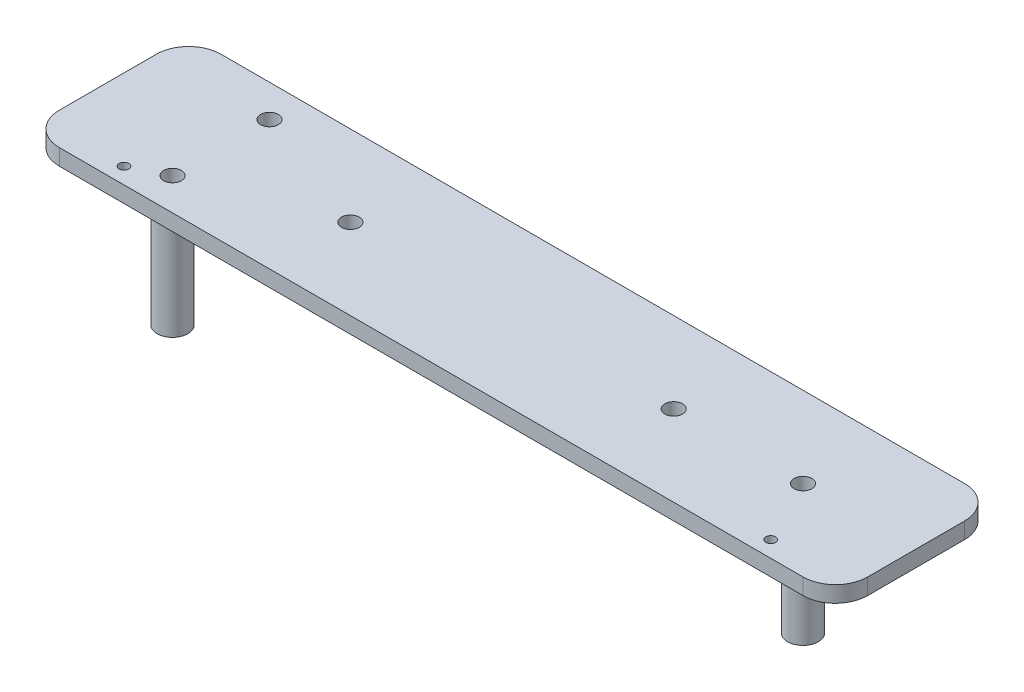
ISO-10303-21;
HEADER;
FILE_DESCRIPTION(('STEP AP214'),'2;1');
FILE_NAME('part.step','',(''),(''),'','','');
FILE_SCHEMA(('AUTOMOTIVE_DESIGN { 1 0 10303 214 1 1 1 1 }'));
ENDSEC;
DATA;
#1=APPLICATION_CONTEXT('core data for automotive mechanical design processes');
#2=APPLICATION_PROTOCOL_DEFINITION('international standard','automotive_design',2000,#1);
#3=PRODUCT_CONTEXT('',#1,'mechanical');
#4=PRODUCT('Part','Part','',(#3));
#5=PRODUCT_RELATED_PRODUCT_CATEGORY('part','',(#4));
#6=PRODUCT_DEFINITION_FORMATION('','',#4);
#7=PRODUCT_DEFINITION_CONTEXT('part definition',#1,'design');
#8=PRODUCT_DEFINITION('design','',#6,#7);
#9=PRODUCT_DEFINITION_SHAPE('','',#8);
#10=(LENGTH_UNIT() NAMED_UNIT(*) SI_UNIT(.MILLI.,.METRE.));
#11=(NAMED_UNIT(*) PLANE_ANGLE_UNIT() SI_UNIT($,.RADIAN.));
#12=(NAMED_UNIT(*) SI_UNIT($,.STERADIAN.) SOLID_ANGLE_UNIT());
#13=UNCERTAINTY_MEASURE_WITH_UNIT(LENGTH_MEASURE(1.E-05),#10,'distance_accuracy_value','');
#14=(GEOMETRIC_REPRESENTATION_CONTEXT(3) GLOBAL_UNCERTAINTY_ASSIGNED_CONTEXT((#13)) GLOBAL_UNIT_ASSIGNED_CONTEXT((#10,
#11,#12)) REPRESENTATION_CONTEXT('',''));
#15=CARTESIAN_POINT('',(0.,0.,0.));
#16=DIRECTION('',(0.,0.,1.));
#17=DIRECTION('',(1.,0.,0.));
#18=AXIS2_PLACEMENT_3D('',#15,#16,#17);
#19=CARTESIAN_POINT('',(115.,0.,-15.));
#20=DIRECTION('',(0.,-1.,0.));
#21=DIRECTION('',(0.,0.,-1.));
#22=AXIS2_PLACEMENT_3D('',#19,#20,#21);
#23=PLANE('',#22);
#24=CARTESIAN_POINT('',(-90.,0.,-15.));
#25=DIRECTION('',(0.,-1.,0.));
#26=DIRECTION('',(0.,0.,1.));
#27=AXIS2_PLACEMENT_3D('',#24,#25,#26);
#28=CIRCLE('',#27,4.75);
#29=CARTESIAN_POINT('',(-90.,0.,-10.25));
#30=VERTEX_POINT('',#29);
#31=EDGE_CURVE('E227',#30,#30,#28,.T.);
#32=ORIENTED_EDGE('',*,*,#31,.F.);
#33=EDGE_LOOP('',(#32));
#34=FACE_BOUND('',#33,.T.);
#35=CARTESIAN_POINT('',(-100.,0.,20.));
#36=DIRECTION('',(0.,1.,0.));
#37=DIRECTION('',(0.,0.,1.));
#38=AXIS2_PLACEMENT_3D('',#35,#36,#37);
#39=CIRCLE('',#38,1.5);
#40=CARTESIAN_POINT('',(-100.,0.,21.5));
#41=VERTEX_POINT('',#40);
#42=EDGE_CURVE('E210',#41,#41,#39,.T.);
#43=ORIENTED_EDGE('',*,*,#42,.T.);
#44=EDGE_LOOP('',(#43));
#45=FACE_BOUND('',#44,.T.);
#46=CARTESIAN_POINT('',(50.,0.,0.));
#47=DIRECTION('',(0.,1.,0.));
#48=DIRECTION('',(0.,0.,-1.));
#49=AXIS2_PLACEMENT_3D('',#46,#47,#48);
#50=CIRCLE('',#49,2.74999999999999);
#51=CARTESIAN_POINT('',(50.,0.,-2.75000000000001));
#52=VERTEX_POINT('',#51);
#53=EDGE_CURVE('E198',#52,#52,#50,.T.);
#54=ORIENTED_EDGE('',*,*,#53,.T.);
#55=EDGE_LOOP('',(#54));
#56=FACE_BOUND('',#55,.T.);
#57=CARTESIAN_POINT('',(115.,0.,-15.));
#58=DIRECTION('',(0.,1.,0.));
#59=DIRECTION('',(0.,0.,-1.));
#60=AXIS2_PLACEMENT_3D('',#57,#58,#59);
#61=CIRCLE('',#60,10.);
#62=CARTESIAN_POINT('',(125.,0.,-15.));
#63=VERTEX_POINT('',#62);
#64=CARTESIAN_POINT('',(115.,0.,-25.));
#65=VERTEX_POINT('',#64);
#66=EDGE_CURVE('E135',#63,#65,#61,.T.);
#67=ORIENTED_EDGE('',*,*,#66,.F.);
#68=DIRECTION('',(0.,0.,-1.));
#69=VECTOR('',#68,1.);
#70=CARTESIAN_POINT('',(125.,0.,-15.));
#71=LINE('',#70,#69);
#72=CARTESIAN_POINT('',(125.,0.,15.));
#73=VERTEX_POINT('',#72);
#74=EDGE_CURVE('E89',#73,#63,#71,.T.);
#75=ORIENTED_EDGE('',*,*,#74,.F.);
#76=CARTESIAN_POINT('',(115.,0.,15.));
#77=DIRECTION('',(0.,1.,0.));
#78=DIRECTION('',(0.,0.,1.));
#79=AXIS2_PLACEMENT_3D('',#76,#77,#78);
#80=CIRCLE('',#79,9.99999999999999);
#81=CARTESIAN_POINT('',(115.,0.,25.));
#82=VERTEX_POINT('',#81);
#83=EDGE_CURVE('E83',#82,#73,#80,.T.);
#84=ORIENTED_EDGE('',*,*,#83,.F.);
#85=DIRECTION('',(1.,0.,0.));
#86=VECTOR('',#85,1.);
#87=CARTESIAN_POINT('',(-115.,0.,25.));
#88=LINE('',#87,#86);
#89=CARTESIAN_POINT('',(-115.,0.,25.));
#90=VERTEX_POINT('',#89);
#91=EDGE_CURVE('E125',#90,#82,#88,.T.);
#92=ORIENTED_EDGE('',*,*,#91,.F.);
#93=CARTESIAN_POINT('',(-115.,0.,15.));
#94=DIRECTION('',(0.,1.,0.));
#95=DIRECTION('',(0.,0.,1.));
#96=AXIS2_PLACEMENT_3D('',#93,#94,#95);
#97=CIRCLE('',#96,9.99999999999999);
#98=CARTESIAN_POINT('',(-125.,0.,15.));
#99=VERTEX_POINT('',#98);
#100=EDGE_CURVE('E145',#99,#90,#97,.T.);
#101=ORIENTED_EDGE('',*,*,#100,.F.);
#102=DIRECTION('',(0.,0.,1.));
#103=VECTOR('',#102,1.);
#104=CARTESIAN_POINT('',(-125.,0.,-15.));
#105=LINE('',#104,#103);
#106=CARTESIAN_POINT('',(-125.,0.,-15.));
#107=VERTEX_POINT('',#106);
#108=EDGE_CURVE('E143',#107,#99,#105,.T.);
#109=ORIENTED_EDGE('',*,*,#108,.F.);
#110=CARTESIAN_POINT('',(-115.,0.,-15.));
#111=DIRECTION('',(0.,1.,0.));
#112=DIRECTION('',(0.,0.,1.));
#113=AXIS2_PLACEMENT_3D('',#110,#111,#112);
#114=CIRCLE('',#113,10.);
#115=CARTESIAN_POINT('',(-115.,0.,-25.));
#116=VERTEX_POINT('',#115);
#117=EDGE_CURVE('E141',#116,#107,#114,.T.);
#118=ORIENTED_EDGE('',*,*,#117,.F.);
#119=DIRECTION('',(-1.,0.,0.));
#120=VECTOR('',#119,1.);
#121=CARTESIAN_POINT('',(-115.,0.,-25.));
#122=LINE('',#121,#120);
#123=EDGE_CURVE('E138',#65,#116,#122,.T.);
#124=ORIENTED_EDGE('',*,*,#123,.F.);
#125=EDGE_LOOP('',(#67,#75,#84,#92,#101,#109,#118,#124));
#126=FACE_BOUND('',#125,.T.);
#127=CARTESIAN_POINT('',(-50.,0.,0.));
#128=DIRECTION('',(0.,1.,0.));
#129=DIRECTION('',(0.,0.,1.));
#130=AXIS2_PLACEMENT_3D('',#127,#128,#129);
#131=CIRCLE('',#130,2.74999999999999);
#132=CARTESIAN_POINT('',(-50.,0.,2.74999999999999));
#133=VERTEX_POINT('',#132);
#134=EDGE_CURVE('E192',#133,#133,#131,.T.);
#135=ORIENTED_EDGE('',*,*,#134,.T.);
#136=EDGE_LOOP('',(#135));
#137=FACE_BOUND('',#136,.T.);
#138=CARTESIAN_POINT('',(100.,0.,20.));
#139=DIRECTION('',(0.,1.,0.));
#140=DIRECTION('',(0.,0.,-1.));
#141=AXIS2_PLACEMENT_3D('',#138,#139,#140);
#142=CIRCLE('',#141,1.5);
#143=CARTESIAN_POINT('',(100.,0.,18.5));
#144=VERTEX_POINT('',#143);
#145=EDGE_CURVE('E204',#144,#144,#142,.T.);
#146=ORIENTED_EDGE('',*,*,#145,.T.);
#147=EDGE_LOOP('',(#146));
#148=FACE_BOUND('',#147,.T.);
#149=CARTESIAN_POINT('',(-90.,0.,15.));
#150=DIRECTION('',(0.,-1.,0.));
#151=DIRECTION('',(0.,0.,-1.));
#152=AXIS2_PLACEMENT_3D('',#149,#150,#151);
#153=CIRCLE('',#152,4.75000000000001);
#154=CARTESIAN_POINT('',(-90.,0.,10.25));
#155=VERTEX_POINT('',#154);
#156=EDGE_CURVE('E216',#155,#155,#153,.T.);
#157=ORIENTED_EDGE('',*,*,#156,.F.);
#158=EDGE_LOOP('',(#157));
#159=FACE_BOUND('',#158,.T.);
#160=CARTESIAN_POINT('',(90.,0.,0.));
#161=DIRECTION('',(0.,-1.,0.));
#162=DIRECTION('',(0.,0.,-1.));
#163=AXIS2_PLACEMENT_3D('',#160,#161,#162);
#164=CIRCLE('',#163,4.75);
#165=CARTESIAN_POINT('',(90.,0.,-4.75));
#166=VERTEX_POINT('',#165);
#167=EDGE_CURVE('E236',#166,#166,#164,.T.);
#168=ORIENTED_EDGE('',*,*,#167,.F.);
#169=EDGE_LOOP('',(#168));
#170=FACE_BOUND('',#169,.T.);
#171=ADVANCED_FACE('F37',(#34,#45,#56,#126,#137,#148,#159,#170),#23,.T.);
#172=CARTESIAN_POINT('',(115.,5.,-15.));
#173=DIRECTION('',(0.,-1.,0.));
#174=DIRECTION('',(0.,0.,-1.));
#175=AXIS2_PLACEMENT_3D('',#172,#173,#174);
#176=PLANE('',#175);
#177=CARTESIAN_POINT('',(115.,5.,-15.));
#178=DIRECTION('',(0.,1.,0.));
#179=DIRECTION('',(0.,0.,-1.));
#180=AXIS2_PLACEMENT_3D('',#177,#178,#179);
#181=CIRCLE('',#180,10.);
#182=CARTESIAN_POINT('',(125.,5.,-15.));
#183=VERTEX_POINT('',#182);
#184=CARTESIAN_POINT('',(115.,5.,-25.));
#185=VERTEX_POINT('',#184);
#186=EDGE_CURVE('E150',#183,#185,#181,.T.);
#187=ORIENTED_EDGE('',*,*,#186,.T.);
#188=DIRECTION('',(-1.,0.,0.));
#189=VECTOR('',#188,1.);
#190=CARTESIAN_POINT('',(-115.,5.,-25.));
#191=LINE('',#190,#189);
#192=CARTESIAN_POINT('',(-115.,5.,-25.));
#193=VERTEX_POINT('',#192);
#194=EDGE_CURVE('E97',#185,#193,#191,.T.);
#195=ORIENTED_EDGE('',*,*,#194,.T.);
#196=CARTESIAN_POINT('',(-115.,5.,-15.));
#197=DIRECTION('',(0.,1.,0.));
#198=DIRECTION('',(0.,0.,1.));
#199=AXIS2_PLACEMENT_3D('',#196,#197,#198);
#200=CIRCLE('',#199,10.);
#201=CARTESIAN_POINT('',(-125.,5.,-15.));
#202=VERTEX_POINT('',#201);
#203=EDGE_CURVE('E165',#193,#202,#200,.T.);
#204=ORIENTED_EDGE('',*,*,#203,.T.);
#205=DIRECTION('',(0.,0.,1.));
#206=VECTOR('',#205,1.);
#207=CARTESIAN_POINT('',(-125.,5.,-15.));
#208=LINE('',#207,#206);
#209=CARTESIAN_POINT('',(-125.,5.,15.));
#210=VERTEX_POINT('',#209);
#211=EDGE_CURVE('E177',#202,#210,#208,.T.);
#212=ORIENTED_EDGE('',*,*,#211,.T.);
#213=CARTESIAN_POINT('',(-115.,5.,15.));
#214=DIRECTION('',(0.,1.,0.));
#215=DIRECTION('',(0.,0.,1.));
#216=AXIS2_PLACEMENT_3D('',#213,#214,#215);
#217=CIRCLE('',#216,9.99999999999999);
#218=CARTESIAN_POINT('',(-115.,5.,25.));
#219=VERTEX_POINT('',#218);
#220=EDGE_CURVE('E117',#210,#219,#217,.T.);
#221=ORIENTED_EDGE('',*,*,#220,.T.);
#222=DIRECTION('',(1.,0.,0.));
#223=VECTOR('',#222,1.);
#224=CARTESIAN_POINT('',(-115.,5.,25.));
#225=LINE('',#224,#223);
#226=CARTESIAN_POINT('',(115.,5.,25.));
#227=VERTEX_POINT('',#226);
#228=EDGE_CURVE('E110',#219,#227,#225,.T.);
#229=ORIENTED_EDGE('',*,*,#228,.T.);
#230=CARTESIAN_POINT('',(115.,5.,15.));
#231=DIRECTION('',(0.,1.,0.));
#232=DIRECTION('',(0.,0.,1.));
#233=AXIS2_PLACEMENT_3D('',#230,#231,#232);
#234=CIRCLE('',#233,9.99999999999999);
#235=CARTESIAN_POINT('',(125.,5.,15.));
#236=VERTEX_POINT('',#235);
#237=EDGE_CURVE('E115',#227,#236,#234,.T.);
#238=ORIENTED_EDGE('',*,*,#237,.T.);
#239=DIRECTION('',(0.,0.,-1.));
#240=VECTOR('',#239,1.);
#241=CARTESIAN_POINT('',(125.,5.,-15.));
#242=LINE('',#241,#240);
#243=EDGE_CURVE('E54',#236,#183,#242,.T.);
#244=ORIENTED_EDGE('',*,*,#243,.T.);
#245=EDGE_LOOP('',(#187,#195,#204,#212,#221,#229,#238,#244));
#246=FACE_BOUND('',#245,.T.);
#247=CARTESIAN_POINT('',(-90.,5.,15.));
#248=DIRECTION('',(0.,1.,0.));
#249=DIRECTION('',(0.,0.,1.));
#250=AXIS2_PLACEMENT_3D('',#247,#248,#249);
#251=CIRCLE('',#250,2.75000000000001);
#252=CARTESIAN_POINT('',(-90.,5.,17.75));
#253=VERTEX_POINT('',#252);
#254=EDGE_CURVE('E139',#253,#253,#251,.T.);
#255=ORIENTED_EDGE('',*,*,#254,.F.);
#256=EDGE_LOOP('',(#255));
#257=FACE_BOUND('',#256,.T.);
#258=CARTESIAN_POINT('',(90.,5.,0.));
#259=DIRECTION('',(0.,1.,0.));
#260=DIRECTION('',(0.,0.,1.));
#261=AXIS2_PLACEMENT_3D('',#258,#259,#260);
#262=CIRCLE('',#261,2.75000000000001);
#263=CARTESIAN_POINT('',(90.,5.,2.75000000000001));
#264=VERTEX_POINT('',#263);
#265=EDGE_CURVE('E185',#264,#264,#262,.T.);
#266=ORIENTED_EDGE('',*,*,#265,.F.);
#267=EDGE_LOOP('',(#266));
#268=FACE_BOUND('',#267,.T.);
#269=CARTESIAN_POINT('',(-90.,5.,-15.));
#270=DIRECTION('',(0.,1.,0.));
#271=DIRECTION('',(0.,0.,-1.));
#272=AXIS2_PLACEMENT_3D('',#269,#270,#271);
#273=CIRCLE('',#272,2.75000000000001);
#274=CARTESIAN_POINT('',(-90.,5.,-17.75));
#275=VERTEX_POINT('',#274);
#276=EDGE_CURVE('E188',#275,#275,#273,.T.);
#277=ORIENTED_EDGE('',*,*,#276,.F.);
#278=EDGE_LOOP('',(#277));
#279=FACE_BOUND('',#278,.T.);
#280=CARTESIAN_POINT('',(-50.,5.,0.));
#281=DIRECTION('',(0.,1.,0.));
#282=DIRECTION('',(0.,0.,1.));
#283=AXIS2_PLACEMENT_3D('',#280,#281,#282);
#284=CIRCLE('',#283,2.74999999999999);
#285=CARTESIAN_POINT('',(-50.,5.,2.74999999999999));
#286=VERTEX_POINT('',#285);
#287=EDGE_CURVE('E191',#286,#286,#284,.T.);
#288=ORIENTED_EDGE('',*,*,#287,.F.);
#289=EDGE_LOOP('',(#288));
#290=FACE_BOUND('',#289,.T.);
#291=CARTESIAN_POINT('',(50.,5.,0.));
#292=DIRECTION('',(0.,1.,0.));
#293=DIRECTION('',(0.,0.,-1.));
#294=AXIS2_PLACEMENT_3D('',#291,#292,#293);
#295=CIRCLE('',#294,2.74999999999999);
#296=CARTESIAN_POINT('',(50.,5.,-2.75000000000001));
#297=VERTEX_POINT('',#296);
#298=EDGE_CURVE('E195',#297,#297,#295,.T.);
#299=ORIENTED_EDGE('',*,*,#298,.F.);
#300=EDGE_LOOP('',(#299));
#301=FACE_BOUND('',#300,.T.);
#302=CARTESIAN_POINT('',(100.,5.,20.));
#303=DIRECTION('',(0.,1.,0.));
#304=DIRECTION('',(0.,0.,-1.));
#305=AXIS2_PLACEMENT_3D('',#302,#303,#304);
#306=CIRCLE('',#305,1.5);
#307=CARTESIAN_POINT('',(100.,5.,18.5));
#308=VERTEX_POINT('',#307);
#309=EDGE_CURVE('E201',#308,#308,#306,.T.);
#310=ORIENTED_EDGE('',*,*,#309,.F.);
#311=EDGE_LOOP('',(#310));
#312=FACE_BOUND('',#311,.T.);
#313=CARTESIAN_POINT('',(-100.,5.,20.));
#314=DIRECTION('',(0.,1.,0.));
#315=DIRECTION('',(0.,0.,1.));
#316=AXIS2_PLACEMENT_3D('',#313,#314,#315);
#317=CIRCLE('',#316,1.5);
#318=CARTESIAN_POINT('',(-100.,5.,21.5));
#319=VERTEX_POINT('',#318);
#320=EDGE_CURVE('E207',#319,#319,#317,.T.);
#321=ORIENTED_EDGE('',*,*,#320,.F.);
#322=EDGE_LOOP('',(#321));
#323=FACE_BOUND('',#322,.T.);
#324=ADVANCED_FACE('F112',(#246,#257,#268,#279,#290,#301,#312,#323),#176,.F.);
#325=CARTESIAN_POINT('',(115.,5.,-15.));
#326=DIRECTION('',(0.,-1.,0.));
#327=DIRECTION('',(0.,0.,-1.));
#328=AXIS2_PLACEMENT_3D('',#325,#326,#327);
#329=CYLINDRICAL_SURFACE('',#328,10.);
#330=ORIENTED_EDGE('',*,*,#66,.T.);
#331=DIRECTION('',(0.,-1.,0.));
#332=VECTOR('',#331,1.);
#333=CARTESIAN_POINT('',(115.,5.,-25.));
#334=LINE('',#333,#332);
#335=EDGE_CURVE('E11',#185,#65,#334,.T.);
#336=ORIENTED_EDGE('',*,*,#335,.F.);
#337=ORIENTED_EDGE('',*,*,#186,.F.);
#338=DIRECTION('',(0.,-1.,0.));
#339=VECTOR('',#338,1.);
#340=CARTESIAN_POINT('',(125.,5.,-15.));
#341=LINE('',#340,#339);
#342=EDGE_CURVE('E131',#183,#63,#341,.T.);
#343=ORIENTED_EDGE('',*,*,#342,.T.);
#344=EDGE_LOOP('',(#330,#336,#337,#343));
#345=FACE_BOUND('',#344,.T.);
#346=ADVANCED_FACE('F39',(#345),#329,.T.);
#347=CARTESIAN_POINT('',(-115.,5.,-25.));
#348=DIRECTION('',(0.,0.,1.));
#349=DIRECTION('',(1.,0.,0.));
#350=AXIS2_PLACEMENT_3D('',#347,#348,#349);
#351=PLANE('',#350);
#352=ORIENTED_EDGE('',*,*,#123,.T.);
#353=DIRECTION('',(0.,-1.,0.));
#354=VECTOR('',#353,1.);
#355=CARTESIAN_POINT('',(-115.,5.,-25.));
#356=LINE('',#355,#354);
#357=EDGE_CURVE('E46',#193,#116,#356,.T.);
#358=ORIENTED_EDGE('',*,*,#357,.F.);
#359=ORIENTED_EDGE('',*,*,#194,.F.);
#360=ORIENTED_EDGE('',*,*,#335,.T.);
#361=EDGE_LOOP('',(#352,#358,#359,#360));
#362=FACE_BOUND('',#361,.T.);
#363=ADVANCED_FACE('F269',(#362),#351,.F.);
#364=CARTESIAN_POINT('',(-115.,5.,-15.));
#365=DIRECTION('',(0.,-1.,0.));
#366=DIRECTION('',(0.,0.,-1.));
#367=AXIS2_PLACEMENT_3D('',#364,#365,#366);
#368=CYLINDRICAL_SURFACE('',#367,10.);
#369=ORIENTED_EDGE('',*,*,#117,.T.);
#370=DIRECTION('',(0.,-1.,0.));
#371=VECTOR('',#370,1.);
#372=CARTESIAN_POINT('',(-125.,5.,-15.));
#373=LINE('',#372,#371);
#374=EDGE_CURVE('E157',#202,#107,#373,.T.);
#375=ORIENTED_EDGE('',*,*,#374,.F.);
#376=ORIENTED_EDGE('',*,*,#203,.F.);
#377=ORIENTED_EDGE('',*,*,#357,.T.);
#378=EDGE_LOOP('',(#369,#375,#376,#377));
#379=FACE_BOUND('',#378,.T.);
#380=ADVANCED_FACE('F163',(#379),#368,.T.);
#381=CARTESIAN_POINT('',(-125.,5.,-15.));
#382=DIRECTION('',(1.,0.,0.));
#383=DIRECTION('',(0.,0.,-1.));
#384=AXIS2_PLACEMENT_3D('',#381,#382,#383);
#385=PLANE('',#384);
#386=ORIENTED_EDGE('',*,*,#108,.T.);
#387=DIRECTION('',(0.,-1.,0.));
#388=VECTOR('',#387,1.);
#389=CARTESIAN_POINT('',(-125.,5.,15.));
#390=LINE('',#389,#388);
#391=EDGE_CURVE('E154',#210,#99,#390,.T.);
#392=ORIENTED_EDGE('',*,*,#391,.F.);
#393=ORIENTED_EDGE('',*,*,#211,.F.);
#394=ORIENTED_EDGE('',*,*,#374,.T.);
#395=EDGE_LOOP('',(#386,#392,#393,#394));
#396=FACE_BOUND('',#395,.T.);
#397=ADVANCED_FACE('F173',(#396),#385,.F.);
#398=CARTESIAN_POINT('',(-115.,5.,15.));
#399=DIRECTION('',(0.,-1.,0.));
#400=DIRECTION('',(0.,0.,-1.));
#401=AXIS2_PLACEMENT_3D('',#398,#399,#400);
#402=CYLINDRICAL_SURFACE('',#401,9.99999999999999);
#403=ORIENTED_EDGE('',*,*,#100,.T.);
#404=DIRECTION('',(0.,-1.,0.));
#405=VECTOR('',#404,1.);
#406=CARTESIAN_POINT('',(-115.,5.,25.));
#407=LINE('',#406,#405);
#408=EDGE_CURVE('E126',#219,#90,#407,.T.);
#409=ORIENTED_EDGE('',*,*,#408,.F.);
#410=ORIENTED_EDGE('',*,*,#220,.F.);
#411=ORIENTED_EDGE('',*,*,#391,.T.);
#412=EDGE_LOOP('',(#403,#409,#410,#411));
#413=FACE_BOUND('',#412,.T.);
#414=ADVANCED_FACE('F176',(#413),#402,.T.);
#415=CARTESIAN_POINT('',(-115.,5.,25.));
#416=DIRECTION('',(0.,0.,-1.));
#417=DIRECTION('',(-1.,0.,0.));
#418=AXIS2_PLACEMENT_3D('',#415,#416,#417);
#419=PLANE('',#418);
#420=ORIENTED_EDGE('',*,*,#91,.T.);
#421=DIRECTION('',(0.,-1.,0.));
#422=VECTOR('',#421,1.);
#423=CARTESIAN_POINT('',(115.,5.,25.));
#424=LINE('',#423,#422);
#425=EDGE_CURVE('E122',#227,#82,#424,.T.);
#426=ORIENTED_EDGE('',*,*,#425,.F.);
#427=ORIENTED_EDGE('',*,*,#228,.F.);
#428=ORIENTED_EDGE('',*,*,#408,.T.);
#429=EDGE_LOOP('',(#420,#426,#427,#428));
#430=FACE_BOUND('',#429,.T.);
#431=ADVANCED_FACE('F123',(#430),#419,.F.);
#432=CARTESIAN_POINT('',(115.,5.,15.));
#433=DIRECTION('',(0.,-1.,0.));
#434=DIRECTION('',(0.,0.,-1.));
#435=AXIS2_PLACEMENT_3D('',#432,#433,#434);
#436=CYLINDRICAL_SURFACE('',#435,9.99999999999999);
#437=ORIENTED_EDGE('',*,*,#83,.T.);
#438=DIRECTION('',(0.,-1.,0.));
#439=VECTOR('',#438,1.);
#440=CARTESIAN_POINT('',(125.,5.,15.));
#441=LINE('',#440,#439);
#442=EDGE_CURVE('E127',#236,#73,#441,.T.);
#443=ORIENTED_EDGE('',*,*,#442,.F.);
#444=ORIENTED_EDGE('',*,*,#237,.F.);
#445=ORIENTED_EDGE('',*,*,#425,.T.);
#446=EDGE_LOOP('',(#437,#443,#444,#445));
#447=FACE_BOUND('',#446,.T.);
#448=ADVANCED_FACE('F129',(#447),#436,.T.);
#449=CARTESIAN_POINT('',(125.,5.,-15.));
#450=DIRECTION('',(-1.,0.,0.));
#451=DIRECTION('',(0.,0.,1.));
#452=AXIS2_PLACEMENT_3D('',#449,#450,#451);
#453=PLANE('',#452);
#454=ORIENTED_EDGE('',*,*,#74,.T.);
#455=ORIENTED_EDGE('',*,*,#342,.F.);
#456=ORIENTED_EDGE('',*,*,#243,.F.);
#457=ORIENTED_EDGE('',*,*,#442,.T.);
#458=EDGE_LOOP('',(#454,#455,#456,#457));
#459=FACE_BOUND('',#458,.T.);
#460=ADVANCED_FACE('F256',(#459),#453,.F.);
#461=CARTESIAN_POINT('',(-90.,5.,15.));
#462=DIRECTION('',(0.,-1.,0.));
#463=DIRECTION('',(0.,0.,-1.));
#464=AXIS2_PLACEMENT_3D('',#461,#462,#463);
#465=CYLINDRICAL_SURFACE('',#464,2.75000000000001);
#466=ORIENTED_EDGE('',*,*,#254,.T.);
#467=EDGE_LOOP('',(#466));
#468=FACE_BOUND('',#467,.T.);
#469=CARTESIAN_POINT('',(-90.,-35.,15.));
#470=DIRECTION('',(0.,-1.,0.));
#471=DIRECTION('',(0.,0.,-1.));
#472=AXIS2_PLACEMENT_3D('',#469,#470,#471);
#473=CIRCLE('',#472,2.75000000000001);
#474=CARTESIAN_POINT('',(-90.,-35.,12.25));
#475=VERTEX_POINT('',#474);
#476=EDGE_CURVE('E219',#475,#475,#473,.T.);
#477=ORIENTED_EDGE('',*,*,#476,.T.);
#478=EDGE_LOOP('',(#477));
#479=FACE_BOUND('',#478,.T.);
#480=ADVANCED_FACE('F259',(#468,#479),#465,.F.);
#481=CARTESIAN_POINT('',(90.,5.,0.));
#482=DIRECTION('',(0.,-1.,0.));
#483=DIRECTION('',(0.,0.,-1.));
#484=AXIS2_PLACEMENT_3D('',#481,#482,#483);
#485=CYLINDRICAL_SURFACE('',#484,2.75000000000001);
#486=ORIENTED_EDGE('',*,*,#265,.T.);
#487=EDGE_LOOP('',(#486));
#488=FACE_BOUND('',#487,.T.);
#489=CARTESIAN_POINT('',(90.,-35.,0.));
#490=DIRECTION('',(0.,-1.,0.));
#491=DIRECTION('',(0.,0.,-1.));
#492=AXIS2_PLACEMENT_3D('',#489,#490,#491);
#493=CIRCLE('',#492,2.75000000000001);
#494=CARTESIAN_POINT('',(90.,-35.,-2.75000000000001));
#495=VERTEX_POINT('',#494);
#496=EDGE_CURVE('E231',#495,#495,#493,.T.);
#497=ORIENTED_EDGE('',*,*,#496,.T.);
#498=EDGE_LOOP('',(#497));
#499=FACE_BOUND('',#498,.T.);
#500=ADVANCED_FACE('F349',(#488,#499),#485,.F.);
#501=CARTESIAN_POINT('',(-90.,5.,-15.));
#502=DIRECTION('',(0.,-1.,0.));
#503=DIRECTION('',(0.,0.,-1.));
#504=AXIS2_PLACEMENT_3D('',#501,#502,#503);
#505=CYLINDRICAL_SURFACE('',#504,2.75000000000001);
#506=ORIENTED_EDGE('',*,*,#276,.T.);
#507=EDGE_LOOP('',(#506));
#508=FACE_BOUND('',#507,.T.);
#509=CARTESIAN_POINT('',(-90.,-35.,-15.));
#510=DIRECTION('',(0.,-1.,0.));
#511=DIRECTION('',(0.,0.,1.));
#512=AXIS2_PLACEMENT_3D('',#509,#510,#511);
#513=CIRCLE('',#512,2.75000000000001);
#514=CARTESIAN_POINT('',(-90.,-35.,-12.25));
#515=VERTEX_POINT('',#514);
#516=EDGE_CURVE('E224',#515,#515,#513,.T.);
#517=ORIENTED_EDGE('',*,*,#516,.T.);
#518=EDGE_LOOP('',(#517));
#519=FACE_BOUND('',#518,.T.);
#520=ADVANCED_FACE('F362',(#508,#519),#505,.F.);
#521=CARTESIAN_POINT('',(-50.,5.,0.));
#522=DIRECTION('',(0.,-1.,0.));
#523=DIRECTION('',(0.,0.,-1.));
#524=AXIS2_PLACEMENT_3D('',#521,#522,#523);
#525=CYLINDRICAL_SURFACE('',#524,2.74999999999999);
#526=ORIENTED_EDGE('',*,*,#287,.T.);
#527=EDGE_LOOP('',(#526));
#528=FACE_BOUND('',#527,.T.);
#529=ORIENTED_EDGE('',*,*,#134,.F.);
#530=EDGE_LOOP('',(#529));
#531=FACE_BOUND('',#530,.T.);
#532=ADVANCED_FACE('F375',(#528,#531),#525,.F.);
#533=CARTESIAN_POINT('',(50.,5.,0.));
#534=DIRECTION('',(0.,-1.,0.));
#535=DIRECTION('',(0.,0.,-1.));
#536=AXIS2_PLACEMENT_3D('',#533,#534,#535);
#537=CYLINDRICAL_SURFACE('',#536,2.74999999999999);
#538=ORIENTED_EDGE('',*,*,#298,.T.);
#539=EDGE_LOOP('',(#538));
#540=FACE_BOUND('',#539,.T.);
#541=ORIENTED_EDGE('',*,*,#53,.F.);
#542=EDGE_LOOP('',(#541));
#543=FACE_BOUND('',#542,.T.);
#544=ADVANCED_FACE('F388',(#540,#543),#537,.F.);
#545=CARTESIAN_POINT('',(100.,5.,20.));
#546=DIRECTION('',(0.,-1.,0.));
#547=DIRECTION('',(0.,0.,-1.));
#548=AXIS2_PLACEMENT_3D('',#545,#546,#547);
#549=CYLINDRICAL_SURFACE('',#548,1.5);
#550=ORIENTED_EDGE('',*,*,#309,.T.);
#551=EDGE_LOOP('',(#550));
#552=FACE_BOUND('',#551,.T.);
#553=ORIENTED_EDGE('',*,*,#145,.F.);
#554=EDGE_LOOP('',(#553));
#555=FACE_BOUND('',#554,.T.);
#556=ADVANCED_FACE('F399',(#552,#555),#549,.F.);
#557=CARTESIAN_POINT('',(-100.,5.,20.));
#558=DIRECTION('',(0.,-1.,0.));
#559=DIRECTION('',(0.,0.,-1.));
#560=AXIS2_PLACEMENT_3D('',#557,#558,#559);
#561=CYLINDRICAL_SURFACE('',#560,1.5);
#562=ORIENTED_EDGE('',*,*,#320,.T.);
#563=EDGE_LOOP('',(#562));
#564=FACE_BOUND('',#563,.T.);
#565=ORIENTED_EDGE('',*,*,#42,.F.);
#566=EDGE_LOOP('',(#565));
#567=FACE_BOUND('',#566,.T.);
#568=ADVANCED_FACE('F410',(#564,#567),#561,.F.);
#569=CARTESIAN_POINT('',(-90.,-35.,15.));
#570=DIRECTION('',(0.,-1.,0.));
#571=DIRECTION('',(0.,0.,-1.));
#572=AXIS2_PLACEMENT_3D('',#569,#570,#571);
#573=PLANE('',#572);
#574=CARTESIAN_POINT('',(-90.,-35.,15.));
#575=DIRECTION('',(0.,-1.,0.));
#576=DIRECTION('',(0.,0.,-1.));
#577=AXIS2_PLACEMENT_3D('',#574,#575,#576);
#578=CIRCLE('',#577,4.75000000000001);
#579=CARTESIAN_POINT('',(-90.,-35.,10.25));
#580=VERTEX_POINT('',#579);
#581=EDGE_CURVE('E213',#580,#580,#578,.T.);
#582=ORIENTED_EDGE('',*,*,#581,.T.);
#583=EDGE_LOOP('',(#582));
#584=FACE_BOUND('',#583,.T.);
#585=ORIENTED_EDGE('',*,*,#476,.F.);
#586=EDGE_LOOP('',(#585));
#587=FACE_BOUND('',#586,.T.);
#588=ADVANCED_FACE('F420',(#584,#587),#573,.T.);
#589=CARTESIAN_POINT('',(-90.,-35.,15.));
#590=DIRECTION('',(0.,1.,0.));
#591=DIRECTION('',(0.,0.,1.));
#592=AXIS2_PLACEMENT_3D('',#589,#590,#591);
#593=CYLINDRICAL_SURFACE('',#592,4.75000000000001);
#594=ORIENTED_EDGE('',*,*,#581,.F.);
#595=EDGE_LOOP('',(#594));
#596=FACE_BOUND('',#595,.T.);
#597=ORIENTED_EDGE('',*,*,#156,.T.);
#598=EDGE_LOOP('',(#597));
#599=FACE_BOUND('',#598,.T.);
#600=ADVANCED_FACE('F434',(#596,#599),#593,.T.);
#601=CARTESIAN_POINT('',(-90.,-35.,-15.));
#602=DIRECTION('',(0.,1.,0.));
#603=DIRECTION('',(0.,0.,1.));
#604=AXIS2_PLACEMENT_3D('',#601,#602,#603);
#605=PLANE('',#604);
#606=CARTESIAN_POINT('',(-90.,-35.,-15.));
#607=DIRECTION('',(0.,-1.,0.));
#608=DIRECTION('',(0.,0.,1.));
#609=AXIS2_PLACEMENT_3D('',#606,#607,#608);
#610=CIRCLE('',#609,4.75);
#611=CARTESIAN_POINT('',(-90.,-35.,-10.25));
#612=VERTEX_POINT('',#611);
#613=EDGE_CURVE('E228',#612,#612,#610,.T.);
#614=ORIENTED_EDGE('',*,*,#613,.T.);
#615=EDGE_LOOP('',(#614));
#616=FACE_BOUND('',#615,.T.);
#617=ORIENTED_EDGE('',*,*,#516,.F.);
#618=EDGE_LOOP('',(#617));
#619=FACE_BOUND('',#618,.T.);
#620=ADVANCED_FACE('F444',(#616,#619),#605,.F.);
#621=CARTESIAN_POINT('',(-90.,-35.,-15.));
#622=DIRECTION('',(0.,1.,0.));
#623=DIRECTION('',(0.,0.,1.));
#624=AXIS2_PLACEMENT_3D('',#621,#622,#623);
#625=CYLINDRICAL_SURFACE('',#624,4.75);
#626=ORIENTED_EDGE('',*,*,#613,.F.);
#627=EDGE_LOOP('',(#626));
#628=FACE_BOUND('',#627,.T.);
#629=ORIENTED_EDGE('',*,*,#31,.T.);
#630=EDGE_LOOP('',(#629));
#631=FACE_BOUND('',#630,.T.);
#632=ADVANCED_FACE('F454',(#628,#631),#625,.T.);
#633=CARTESIAN_POINT('',(90.,-35.,0.));
#634=DIRECTION('',(0.,-1.,0.));
#635=DIRECTION('',(0.,0.,-1.));
#636=AXIS2_PLACEMENT_3D('',#633,#634,#635);
#637=PLANE('',#636);
#638=CARTESIAN_POINT('',(90.,-35.,0.));
#639=DIRECTION('',(0.,-1.,0.));
#640=DIRECTION('',(0.,0.,-1.));
#641=AXIS2_PLACEMENT_3D('',#638,#639,#640);
#642=CIRCLE('',#641,4.75);
#643=CARTESIAN_POINT('',(90.,-35.,-4.75));
#644=VERTEX_POINT('',#643);
#645=EDGE_CURVE('E237',#644,#644,#642,.T.);
#646=ORIENTED_EDGE('',*,*,#645,.T.);
#647=EDGE_LOOP('',(#646));
#648=FACE_BOUND('',#647,.T.);
#649=ORIENTED_EDGE('',*,*,#496,.F.);
#650=EDGE_LOOP('',(#649));
#651=FACE_BOUND('',#650,.T.);
#652=ADVANCED_FACE('F464',(#648,#651),#637,.T.);
#653=CARTESIAN_POINT('',(90.,-35.,0.));
#654=DIRECTION('',(0.,1.,0.));
#655=DIRECTION('',(0.,0.,1.));
#656=AXIS2_PLACEMENT_3D('',#653,#654,#655);
#657=CYLINDRICAL_SURFACE('',#656,4.75);
#658=ORIENTED_EDGE('',*,*,#645,.F.);
#659=EDGE_LOOP('',(#658));
#660=FACE_BOUND('',#659,.T.);
#661=ORIENTED_EDGE('',*,*,#167,.T.);
#662=EDGE_LOOP('',(#661));
#663=FACE_BOUND('',#662,.T.);
#664=ADVANCED_FACE('F243',(#660,#663),#657,.T.);
#665=CLOSED_SHELL('',(#171,#324,#346,#363,#380,#397,#414,#431,#448,#460,#480,#500,#520,#532,
#544,#556,#568,#588,#600,#620,#632,#652,#664));
#666=MANIFOLD_SOLID_BREP('B2',#665);
#667=ADVANCED_BREP_SHAPE_REPRESENTATION('',(#18,#666),#14);
#668=SHAPE_DEFINITION_REPRESENTATION(#9,#667);
ENDSEC;
END-ISO-10303-21;
